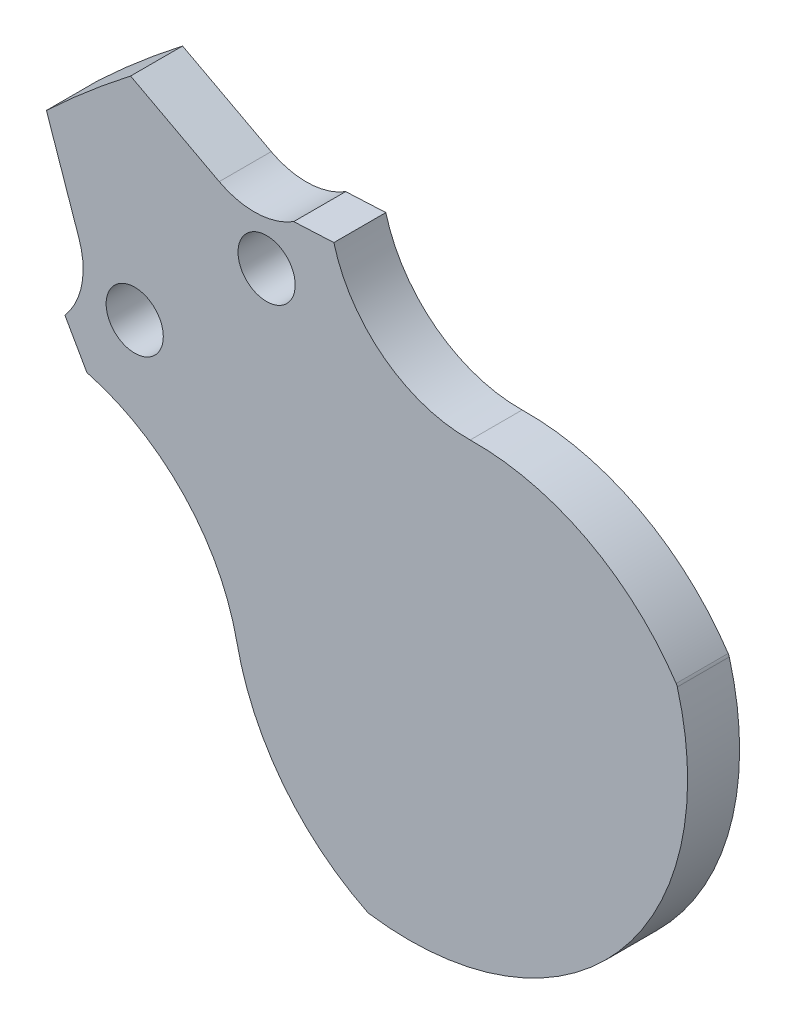
ISO-10303-21;
HEADER;
FILE_DESCRIPTION(('STEP AP214'),'2;1');
FILE_NAME('part.step','',(''),(''),'','','');
FILE_SCHEMA(('AUTOMOTIVE_DESIGN { 1 0 10303 214 1 1 1 1 }'));
ENDSEC;
DATA;
#1=APPLICATION_CONTEXT('core data for automotive mechanical design processes');
#2=APPLICATION_PROTOCOL_DEFINITION('international standard','automotive_design',2000,#1);
#3=PRODUCT_CONTEXT('',#1,'mechanical');
#4=PRODUCT('Part','Part','',(#3));
#5=PRODUCT_RELATED_PRODUCT_CATEGORY('part','',(#4));
#6=PRODUCT_DEFINITION_FORMATION('','',#4);
#7=PRODUCT_DEFINITION_CONTEXT('part definition',#1,'design');
#8=PRODUCT_DEFINITION('design','',#6,#7);
#9=PRODUCT_DEFINITION_SHAPE('','',#8);
#10=(LENGTH_UNIT() NAMED_UNIT(*) SI_UNIT(.MILLI.,.METRE.));
#11=(NAMED_UNIT(*) PLANE_ANGLE_UNIT() SI_UNIT($,.RADIAN.));
#12=(NAMED_UNIT(*) SI_UNIT($,.STERADIAN.) SOLID_ANGLE_UNIT());
#13=UNCERTAINTY_MEASURE_WITH_UNIT(LENGTH_MEASURE(1.E-05),#10,'distance_accuracy_value','');
#14=(GEOMETRIC_REPRESENTATION_CONTEXT(3) GLOBAL_UNCERTAINTY_ASSIGNED_CONTEXT((#13)) GLOBAL_UNIT_ASSIGNED_CONTEXT((#10,
#11,#12)) REPRESENTATION_CONTEXT('',''));
#15=CARTESIAN_POINT('',(0.,0.,0.));
#16=DIRECTION('',(0.,0.,1.));
#17=DIRECTION('',(1.,0.,0.));
#18=AXIS2_PLACEMENT_3D('',#15,#16,#17);
#19=CARTESIAN_POINT('',(0.,0.,0.));
#20=DIRECTION('',(0.,0.,-1.));
#21=DIRECTION('',(-1.,0.,0.));
#22=AXIS2_PLACEMENT_3D('',#19,#20,#21);
#23=PLANE('',#22);
#24=CARTESIAN_POINT('',(-40.305086527633,40.3050865276334,0.));
#25=DIRECTION('',(0.,0.,1.));
#26=DIRECTION('',(1.,0.,0.));
#27=AXIS2_PLACEMENT_3D('',#24,#25,#26);
#28=CIRCLE('',#27,1.65);
#29=CARTESIAN_POINT('',(-38.655086527633,40.3050865276334,0.));
#30=VERTEX_POINT('',#29);
#31=EDGE_CURVE('E213',#30,#30,#28,.T.);
#32=ORIENTED_EDGE('',*,*,#31,.T.);
#33=EDGE_LOOP('',(#32));
#34=FACE_BOUND('',#33,.T.);
#35=CARTESIAN_POINT('',(-32.6938568720097,46.6916665244725,0.));
#36=DIRECTION('',(0.,0.,1.));
#37=DIRECTION('',(1.,0.,0.));
#38=AXIS2_PLACEMENT_3D('',#35,#36,#37);
#39=CIRCLE('',#38,1.65);
#40=CARTESIAN_POINT('',(-31.0438568720097,46.6916665244725,0.));
#41=VERTEX_POINT('',#40);
#42=EDGE_CURVE('E217',#41,#41,#39,.T.);
#43=ORIENTED_EDGE('',*,*,#42,.T.);
#44=EDGE_LOOP('',(#43));
#45=FACE_BOUND('',#44,.T.);
#46=DIRECTION('',(-0.325568154457158,0.945518575599316,0.));
#47=VECTOR('',#46,1.);
#48=CARTESIAN_POINT('',(-25.7393794242524,-8.86277908471,0.));
#49=LINE('',#48,#47);
#50=CARTESIAN_POINT('',(-43.5149356100677,42.7611845468722,0.));
#51=VERTEX_POINT('',#50);
#52=CARTESIAN_POINT('',(-45.4014737679797,48.2400891862308,0.));
#53=VERTEX_POINT('',#52);
#54=EDGE_CURVE('E200',#51,#53,#49,.T.);
#55=ORIENTED_EDGE('',*,*,#54,.T.);
#56=CARTESIAN_POINT('',(0.,0.,0.));
#57=DIRECTION('',(0.,0.,-1.));
#58=DIRECTION('',(-1.,0.,0.));
#59=AXIS2_PLACEMENT_3D('',#56,#57,#58);
#60=CIRCLE('',#59,66.245);
#61=CARTESIAN_POINT('',(-40.5438183775776,52.3889188318103,0.));
#62=VERTEX_POINT('',#61);
#63=EDGE_CURVE('E108',#53,#62,#60,.T.);
#64=ORIENTED_EDGE('',*,*,#63,.T.);
#65=DIRECTION('',(-0.882947592858929,0.469471562785887,0.));
#66=VECTOR('',#65,1.);
#67=CARTESIAN_POINT('',(12.7801896179389,24.0360408466023,0.));
#68=LINE('',#67,#66);
#69=CARTESIAN_POINT('',(-35.4274877335618,49.6685175728884,0.));
#70=VERTEX_POINT('',#69);
#71=EDGE_CURVE('E198',#70,#62,#68,.T.);
#72=ORIENTED_EDGE('',*,*,#71,.F.);
#73=CARTESIAN_POINT('',(-33.4087600135825,53.4651922221818,0.));
#74=DIRECTION('',(0.,0.,1.));
#75=DIRECTION('',(0.,1.,0.));
#76=AXIS2_PLACEMENT_3D('',#73,#74,#75);
#77=CIRCLE('',#76,4.3);
#78=CARTESIAN_POINT('',(-31.1301071773797,49.8185854087092,0.));
#79=VERTEX_POINT('',#78);
#80=EDGE_CURVE('E206',#70,#79,#77,.T.);
#81=ORIENTED_EDGE('',*,*,#80,.T.);
#82=DIRECTION('',(0.998841807465223,0.0481149005985286,0.));
#83=VECTOR('',#82,1.);
#84=CARTESIAN_POINT('',(-28.8119682022395,49.9302517662133,0.));
#85=LINE('',#84,#83);
#86=CARTESIAN_POINT('',(-28.8119682022395,49.9302517662133,0.));
#87=VERTEX_POINT('',#86);
#88=EDGE_CURVE('E101',#79,#87,#85,.T.);
#89=ORIENTED_EDGE('',*,*,#88,.T.);
#90=CARTESIAN_POINT('',(-21.0834518417378,51.9966580344622,0.));
#91=DIRECTION('',(0.,0.,-1.));
#92=DIRECTION('',(1.,0.,0.));
#93=AXIS2_PLACEMENT_3D('',#90,#91,#92);
#94=CIRCLE('',#93,8.);
#95=CARTESIAN_POINT('',(-20.9440148083786,43.9978732946577,0.));
#96=VERTEX_POINT('',#95);
#97=EDGE_CURVE('E249',#96,#87,#94,.T.);
#98=ORIENTED_EDGE('',*,*,#97,.F.);
#99=CARTESIAN_POINT('',(-20.7,30.,0.));
#100=DIRECTION('',(0.,0.,1.));
#101=DIRECTION('',(1.,0.,0.));
#102=AXIS2_PLACEMENT_3D('',#99,#100,#101);
#103=CIRCLE('',#102,14.);
#104=CARTESIAN_POINT('',(-9.05558126311799,37.7722269833138,0.));
#105=VERTEX_POINT('',#104);
#106=EDGE_CURVE('E247',#105,#96,#103,.T.);
#107=ORIENTED_EDGE('',*,*,#106,.F.);
#108=CARTESIAN_POINT('',(-9.47145336086377,37.4946474481955,0.));
#109=DIRECTION('',(0.,0.,1.));
#110=DIRECTION('',(-1.,0.,0.));
#111=AXIS2_PLACEMENT_3D('',#108,#109,#110);
#112=CIRCLE('',#111,0.499999999999996);
#113=CARTESIAN_POINT('',(-8.9899709162586,37.6294608582741,0.));
#114=VERTEX_POINT('',#113);
#115=EDGE_CURVE('E245',#114,#105,#112,.T.);
#116=ORIENTED_EDGE('',*,*,#115,.F.);
#117=CARTESIAN_POINT('',(-24.4575686104347,33.2985872942633,0.));
#118=DIRECTION('',(0.,0.,1.));
#119=DIRECTION('',(1.,0.,0.));
#120=AXIS2_PLACEMENT_3D('',#117,#118,#119);
#121=CIRCLE('',#120,16.0624731674898);
#122=CARTESIAN_POINT('',(-26.7481863066767,17.4002818868939,0.));
#123=VERTEX_POINT('',#122);
#124=EDGE_CURVE('E242',#123,#114,#121,.T.);
#125=ORIENTED_EDGE('',*,*,#124,.F.);
#126=CARTESIAN_POINT('',(-26.6768829129727,17.8951715978864,0.));
#127=DIRECTION('',(0.,0.,1.));
#128=DIRECTION('',(1.,0.,0.));
#129=AXIS2_PLACEMENT_3D('',#126,#127,#128);
#130=CIRCLE('',#129,0.499999999999999);
#131=CARTESIAN_POINT('',(-26.8982489467865,17.4468446200304,0.));
#132=VERTEX_POINT('',#131);
#133=EDGE_CURVE('E239',#132,#123,#130,.T.);
#134=ORIENTED_EDGE('',*,*,#133,.F.);
#135=CARTESIAN_POINT('',(-20.7,30.,0.));
#136=DIRECTION('',(0.,0.,1.));
#137=DIRECTION('',(1.,0.,0.));
#138=AXIS2_PLACEMENT_3D('',#135,#136,#137);
#139=CIRCLE('',#138,14.);
#140=CARTESIAN_POINT('',(-34.4073900533592,27.1526401834206,0.));
#141=VERTEX_POINT('',#140);
#142=EDGE_CURVE('E225',#141,#132,#139,.T.);
#143=ORIENTED_EDGE('',*,*,#142,.F.);
#144=CARTESIAN_POINT('',(-46.156581527667,24.7120460549241,0.));
#145=DIRECTION('',(0.,0.,-1.));
#146=DIRECTION('',(-1.,0.,0.));
#147=AXIS2_PLACEMENT_3D('',#144,#145,#146);
#148=CIRCLE('',#147,12.);
#149=CARTESIAN_POINT('',(-43.0662239815876,36.3072903489176,0.));
#150=VERTEX_POINT('',#149);
#151=EDGE_CURVE('E252',#150,#141,#148,.T.);
#152=ORIENTED_EDGE('',*,*,#151,.F.);
#153=DIRECTION('',(-0.494156169465709,0.869373153587674,0.));
#154=VECTOR('',#153,1.);
#155=CARTESIAN_POINT('',(-44.3354142901868,38.5401876580473,0.));
#156=LINE('',#155,#154);
#157=CARTESIAN_POINT('',(-44.3354142901868,38.5401876580473,0.));
#158=VERTEX_POINT('',#157);
#159=EDGE_CURVE('E315',#150,#158,#156,.T.);
#160=ORIENTED_EDGE('',*,*,#159,.T.);
#161=CARTESIAN_POINT('',(-47.5806654851447,41.3612414827064,0.));
#162=DIRECTION('',(0.,0.,1.));
#163=DIRECTION('',(0.,1.,0.));
#164=AXIS2_PLACEMENT_3D('',#161,#162,#163);
#165=CIRCLE('',#164,4.3);
#166=EDGE_CURVE('E291',#158,#51,#165,.T.);
#167=ORIENTED_EDGE('',*,*,#166,.T.);
#168=EDGE_LOOP('',(#55,#64,#72,#81,#89,#98,#107,#116,#125,#134,#143,#152,#160,#167));
#169=FACE_BOUND('',#168,.T.);
#170=ADVANCED_FACE('F87',(#34,#45,#169),#23,.T.);
#171=CARTESIAN_POINT('',(-21.0834518417378,51.9966580344622,3.));
#172=DIRECTION('',(0.,0.,-1.));
#173=DIRECTION('',(-1.,0.,0.));
#174=AXIS2_PLACEMENT_3D('',#171,#172,#173);
#175=CYLINDRICAL_SURFACE('',#174,8.);
#176=DIRECTION('',(0.,0.,-1.));
#177=VECTOR('',#176,1.);
#178=CARTESIAN_POINT('',(-28.8119682022395,49.9302517662133,115.));
#179=LINE('',#178,#177);
#180=CARTESIAN_POINT('',(-28.8119682022395,49.9302517662133,3.));
#181=VERTEX_POINT('',#180);
#182=EDGE_CURVE('E192',#181,#87,#179,.T.);
#183=ORIENTED_EDGE('',*,*,#182,.F.);
#184=CARTESIAN_POINT('',(-21.0834518417378,51.9966580344622,3.));
#185=DIRECTION('',(0.,0.,-1.));
#186=DIRECTION('',(1.,0.,0.));
#187=AXIS2_PLACEMENT_3D('',#184,#185,#186);
#188=CIRCLE('',#187,8.);
#189=CARTESIAN_POINT('',(-20.9440148083786,43.9978732946577,3.));
#190=VERTEX_POINT('',#189);
#191=EDGE_CURVE('E231',#190,#181,#188,.T.);
#192=ORIENTED_EDGE('',*,*,#191,.F.);
#193=DIRECTION('',(0.,0.,-1.));
#194=VECTOR('',#193,1.);
#195=CARTESIAN_POINT('',(-20.9440148083786,43.9978732946577,3.));
#196=LINE('',#195,#194);
#197=EDGE_CURVE('E260',#190,#96,#196,.T.);
#198=ORIENTED_EDGE('',*,*,#197,.T.);
#199=ORIENTED_EDGE('',*,*,#97,.T.);
#200=EDGE_LOOP('',(#183,#192,#198,#199));
#201=FACE_BOUND('',#200,.T.);
#202=ADVANCED_FACE('F321',(#201),#175,.F.);
#203=CARTESIAN_POINT('',(-46.156581527667,24.7120460549241,3.));
#204=DIRECTION('',(0.,0.,-1.));
#205=DIRECTION('',(-1.,0.,0.));
#206=AXIS2_PLACEMENT_3D('',#203,#204,#205);
#207=CYLINDRICAL_SURFACE('',#206,12.);
#208=DIRECTION('',(0.,0.,-1.));
#209=VECTOR('',#208,1.);
#210=CARTESIAN_POINT('',(-43.0662239815876,36.3072903489176,115.));
#211=LINE('',#210,#209);
#212=CARTESIAN_POINT('',(-43.0662239815876,36.3072903489176,3.));
#213=VERTEX_POINT('',#212);
#214=EDGE_CURVE('E310',#213,#150,#211,.T.);
#215=ORIENTED_EDGE('',*,*,#214,.T.);
#216=ORIENTED_EDGE('',*,*,#151,.T.);
#217=DIRECTION('',(0.,0.,-1.));
#218=VECTOR('',#217,1.);
#219=CARTESIAN_POINT('',(-34.4073900533592,27.1526401834206,3.));
#220=LINE('',#219,#218);
#221=CARTESIAN_POINT('',(-34.4073900533592,27.1526401834206,3.));
#222=VERTEX_POINT('',#221);
#223=EDGE_CURVE('E257',#222,#141,#220,.T.);
#224=ORIENTED_EDGE('',*,*,#223,.F.);
#225=CARTESIAN_POINT('',(-46.156581527667,24.7120460549241,3.));
#226=DIRECTION('',(0.,0.,-1.));
#227=DIRECTION('',(-1.,0.,0.));
#228=AXIS2_PLACEMENT_3D('',#225,#226,#227);
#229=CIRCLE('',#228,12.);
#230=EDGE_CURVE('E234',#213,#222,#229,.T.);
#231=ORIENTED_EDGE('',*,*,#230,.F.);
#232=EDGE_LOOP('',(#215,#216,#224,#231));
#233=FACE_BOUND('',#232,.T.);
#234=ADVANCED_FACE('F348',(#233),#207,.F.);
#235=CARTESIAN_POINT('',(-25.5672257617037,25.5968794460749,3.));
#236=DIRECTION('',(0.,0.,1.));
#237=DIRECTION('',(1.,0.,0.));
#238=AXIS2_PLACEMENT_3D('',#235,#236,#237);
#239=PLANE('',#238);
#240=CARTESIAN_POINT('',(-40.305086527633,40.3050865276334,3.));
#241=DIRECTION('',(0.,0.,1.));
#242=DIRECTION('',(1.,0.,0.));
#243=AXIS2_PLACEMENT_3D('',#240,#241,#242);
#244=CIRCLE('',#243,1.65);
#245=CARTESIAN_POINT('',(-38.655086527633,40.3050865276334,3.));
#246=VERTEX_POINT('',#245);
#247=EDGE_CURVE('E243',#246,#246,#244,.F.);
#248=ORIENTED_EDGE('',*,*,#247,.T.);
#249=EDGE_LOOP('',(#248));
#250=FACE_BOUND('',#249,.T.);
#251=CARTESIAN_POINT('',(-32.6938568720097,46.6916665244725,3.));
#252=DIRECTION('',(0.,0.,1.));
#253=DIRECTION('',(1.,0.,0.));
#254=AXIS2_PLACEMENT_3D('',#251,#252,#253);
#255=CIRCLE('',#254,1.65);
#256=CARTESIAN_POINT('',(-31.0438568720097,46.6916665244725,3.));
#257=VERTEX_POINT('',#256);
#258=EDGE_CURVE('E216',#257,#257,#255,.F.);
#259=ORIENTED_EDGE('',*,*,#258,.T.);
#260=EDGE_LOOP('',(#259));
#261=FACE_BOUND('',#260,.T.);
#262=DIRECTION('',(0.882947592858929,-0.469471562785887,0.));
#263=VECTOR('',#262,1.);
#264=CARTESIAN_POINT('',(-17.7623162670816,40.2757792922438,3.));
#265=LINE('',#264,#263);
#266=CARTESIAN_POINT('',(-40.5438183775776,52.3889188318103,3.));
#267=VERTEX_POINT('',#266);
#268=CARTESIAN_POINT('',(-35.4274877335618,49.6685175728884,3.));
#269=VERTEX_POINT('',#268);
#270=EDGE_CURVE('E279',#267,#269,#265,.T.);
#271=ORIENTED_EDGE('',*,*,#270,.F.);
#272=CARTESIAN_POINT('',(0.,0.,3.));
#273=DIRECTION('',(0.,0.,1.));
#274=DIRECTION('',(1.,0.,0.));
#275=AXIS2_PLACEMENT_3D('',#272,#273,#274);
#276=CIRCLE('',#275,66.245);
#277=CARTESIAN_POINT('',(-45.4014737679796,48.2400891862304,3.));
#278=VERTEX_POINT('',#277);
#279=EDGE_CURVE('E187',#267,#278,#276,.T.);
#280=ORIENTED_EDGE('',*,*,#279,.T.);
#281=DIRECTION('',(0.325568154457158,-0.945518575599316,0.));
#282=VECTOR('',#281,1.);
#283=CARTESIAN_POINT('',(-36.3288741667994,21.8913467356857,3.));
#284=LINE('',#283,#282);
#285=CARTESIAN_POINT('',(-43.5149356100677,42.7611845468722,3.));
#286=VERTEX_POINT('',#285);
#287=EDGE_CURVE('E281',#278,#286,#284,.T.);
#288=ORIENTED_EDGE('',*,*,#287,.T.);
#289=CARTESIAN_POINT('',(-47.5806654851447,41.3612414827064,3.));
#290=DIRECTION('',(0.,0.,1.));
#291=DIRECTION('',(1.,0.,0.));
#292=AXIS2_PLACEMENT_3D('',#289,#290,#291);
#293=CIRCLE('',#292,4.3);
#294=CARTESIAN_POINT('',(-44.3354142901868,38.5401876580473,3.));
#295=VERTEX_POINT('',#294);
#296=EDGE_CURVE('E283',#286,#295,#293,.F.);
#297=ORIENTED_EDGE('',*,*,#296,.T.);
#298=DIRECTION('',(0.494156169465709,-0.869373153587674,0.));
#299=VECTOR('',#298,1.);
#300=CARTESIAN_POINT('',(-34.1918800729604,20.6945816009796,3.));
#301=LINE('',#300,#299);
#302=EDGE_CURVE('E191',#295,#213,#301,.T.);
#303=ORIENTED_EDGE('',*,*,#302,.T.);
#304=ORIENTED_EDGE('',*,*,#230,.T.);
#305=CARTESIAN_POINT('',(-20.7,30.,3.));
#306=DIRECTION('',(0.,0.,1.));
#307=DIRECTION('',(1.,0.,0.));
#308=AXIS2_PLACEMENT_3D('',#305,#306,#307);
#309=CIRCLE('',#308,14.);
#310=CARTESIAN_POINT('',(-26.8982489467865,17.4468446200304,3.));
#311=VERTEX_POINT('',#310);
#312=EDGE_CURVE('E236',#222,#311,#309,.T.);
#313=ORIENTED_EDGE('',*,*,#312,.T.);
#314=CARTESIAN_POINT('',(-26.6768829129727,17.8951715978864,3.));
#315=DIRECTION('',(0.,0.,1.));
#316=DIRECTION('',(1.,0.,0.));
#317=AXIS2_PLACEMENT_3D('',#314,#315,#316);
#318=CIRCLE('',#317,0.499999999999999);
#319=CARTESIAN_POINT('',(-26.7481863066767,17.4002818868939,3.));
#320=VERTEX_POINT('',#319);
#321=EDGE_CURVE('E221',#311,#320,#318,.T.);
#322=ORIENTED_EDGE('',*,*,#321,.T.);
#323=CARTESIAN_POINT('',(-24.4575686104347,33.2985872942633,3.));
#324=DIRECTION('',(0.,0.,1.));
#325=DIRECTION('',(1.,0.,0.));
#326=AXIS2_PLACEMENT_3D('',#323,#324,#325);
#327=CIRCLE('',#326,16.0624731674898);
#328=CARTESIAN_POINT('',(-8.9899709162586,37.6294608582741,3.));
#329=VERTEX_POINT('',#328);
#330=EDGE_CURVE('E224',#320,#329,#327,.T.);
#331=ORIENTED_EDGE('',*,*,#330,.T.);
#332=CARTESIAN_POINT('',(-9.47145336086377,37.4946474481955,3.));
#333=DIRECTION('',(0.,0.,1.));
#334=DIRECTION('',(-1.,0.,0.));
#335=AXIS2_PLACEMENT_3D('',#332,#333,#334);
#336=CIRCLE('',#335,0.499999999999996);
#337=CARTESIAN_POINT('',(-9.05558126311799,37.7722269833138,3.));
#338=VERTEX_POINT('',#337);
#339=EDGE_CURVE('E227',#329,#338,#336,.T.);
#340=ORIENTED_EDGE('',*,*,#339,.T.);
#341=CARTESIAN_POINT('',(-20.7,30.,3.));
#342=DIRECTION('',(0.,0.,1.));
#343=DIRECTION('',(1.,0.,0.));
#344=AXIS2_PLACEMENT_3D('',#341,#342,#343);
#345=CIRCLE('',#344,14.);
#346=EDGE_CURVE('E229',#338,#190,#345,.T.);
#347=ORIENTED_EDGE('',*,*,#346,.T.);
#348=ORIENTED_EDGE('',*,*,#191,.T.);
#349=DIRECTION('',(-0.998841807465223,-0.0481149005985286,0.));
#350=VECTOR('',#349,1.);
#351=CARTESIAN_POINT('',(-26.7441792632676,50.0298585893496,3.));
#352=LINE('',#351,#350);
#353=CARTESIAN_POINT('',(-31.1301071773797,49.8185854087092,3.));
#354=VERTEX_POINT('',#353);
#355=EDGE_CURVE('E209',#181,#354,#352,.T.);
#356=ORIENTED_EDGE('',*,*,#355,.T.);
#357=CARTESIAN_POINT('',(-33.4087600135825,53.4651922221818,3.));
#358=DIRECTION('',(0.,0.,1.));
#359=DIRECTION('',(1.,0.,0.));
#360=AXIS2_PLACEMENT_3D('',#357,#358,#359);
#361=CIRCLE('',#360,4.3);
#362=EDGE_CURVE('E272',#354,#269,#361,.F.);
#363=ORIENTED_EDGE('',*,*,#362,.T.);
#364=EDGE_LOOP('',(#271,#280,#288,#297,#303,#304,#313,#322,#331,#340,#347,#348,#356,#363));
#365=FACE_BOUND('',#364,.T.);
#366=ADVANCED_FACE('F296',(#250,#261,#365),#239,.T.);
#367=CARTESIAN_POINT('',(12.7801896179389,24.0360408466023,115.));
#368=DIRECTION('',(-0.469471562785887,-0.882947592858929,0.));
#369=DIRECTION('',(0.882947592858929,-0.469471562785887,0.));
#370=AXIS2_PLACEMENT_3D('',#367,#368,#369);
#371=PLANE('',#370);
#372=DIRECTION('',(0.,0.,-1.));
#373=VECTOR('',#372,1.);
#374=CARTESIAN_POINT('',(-40.5438183775776,52.3889188318103,115.));
#375=LINE('',#374,#373);
#376=EDGE_CURVE('E184',#267,#62,#375,.T.);
#377=ORIENTED_EDGE('',*,*,#376,.F.);
#378=ORIENTED_EDGE('',*,*,#270,.T.);
#379=DIRECTION('',(0.,0.,-1.));
#380=VECTOR('',#379,1.);
#381=CARTESIAN_POINT('',(-35.4274877335618,49.6685175728884,115.));
#382=LINE('',#381,#380);
#383=EDGE_CURVE('E204',#269,#70,#382,.T.);
#384=ORIENTED_EDGE('',*,*,#383,.T.);
#385=ORIENTED_EDGE('',*,*,#71,.T.);
#386=EDGE_LOOP('',(#377,#378,#384,#385));
#387=FACE_BOUND('',#386,.T.);
#388=ADVANCED_FACE('F202',(#387),#371,.F.);
#389=CARTESIAN_POINT('',(-33.4087600135825,53.4651922221818,115.));
#390=DIRECTION('',(0.,0.,-1.));
#391=DIRECTION('',(-1.,0.,0.));
#392=AXIS2_PLACEMENT_3D('',#389,#390,#391);
#393=CYLINDRICAL_SURFACE('',#392,4.3);
#394=ORIENTED_EDGE('',*,*,#362,.F.);
#395=DIRECTION('',(0.,0.,-1.));
#396=VECTOR('',#395,1.);
#397=CARTESIAN_POINT('',(-31.1301071773797,49.8185854087092,115.));
#398=LINE('',#397,#396);
#399=EDGE_CURVE('E12',#354,#79,#398,.T.);
#400=ORIENTED_EDGE('',*,*,#399,.T.);
#401=ORIENTED_EDGE('',*,*,#80,.F.);
#402=ORIENTED_EDGE('',*,*,#383,.F.);
#403=EDGE_LOOP('',(#394,#400,#401,#402));
#404=FACE_BOUND('',#403,.T.);
#405=ADVANCED_FACE('F401',(#404),#393,.F.);
#406=CARTESIAN_POINT('',(-25.7393794242524,-8.86277908471,115.));
#407=DIRECTION('',(-0.945518575599316,-0.325568154457158,0.));
#408=DIRECTION('',(0.325568154457158,-0.945518575599316,0.));
#409=AXIS2_PLACEMENT_3D('',#406,#407,#408);
#410=PLANE('',#409);
#411=ORIENTED_EDGE('',*,*,#287,.F.);
#412=DIRECTION('',(0.,0.,-1.));
#413=VECTOR('',#412,1.);
#414=CARTESIAN_POINT('',(-45.4014737679796,48.2400891862304,115.));
#415=LINE('',#414,#413);
#416=EDGE_CURVE('E313',#278,#53,#415,.T.);
#417=ORIENTED_EDGE('',*,*,#416,.T.);
#418=ORIENTED_EDGE('',*,*,#54,.F.);
#419=DIRECTION('',(0.,0.,-1.));
#420=VECTOR('',#419,1.);
#421=CARTESIAN_POINT('',(-43.5149356100677,42.7611845468722,115.));
#422=LINE('',#421,#420);
#423=EDGE_CURVE('E220',#286,#51,#422,.T.);
#424=ORIENTED_EDGE('',*,*,#423,.F.);
#425=EDGE_LOOP('',(#411,#417,#418,#424));
#426=FACE_BOUND('',#425,.T.);
#427=ADVANCED_FACE('F301',(#426),#410,.T.);
#428=CARTESIAN_POINT('',(-47.5806654851447,41.3612414827064,115.));
#429=DIRECTION('',(0.,0.,-1.));
#430=DIRECTION('',(-1.,0.,0.));
#431=AXIS2_PLACEMENT_3D('',#428,#429,#430);
#432=CYLINDRICAL_SURFACE('',#431,4.3);
#433=ORIENTED_EDGE('',*,*,#166,.F.);
#434=DIRECTION('',(0.,0.,-1.));
#435=VECTOR('',#434,1.);
#436=CARTESIAN_POINT('',(-44.3354142901868,38.5401876580473,115.));
#437=LINE('',#436,#435);
#438=EDGE_CURVE('E94',#158,#295,#437,.F.);
#439=ORIENTED_EDGE('',*,*,#438,.T.);
#440=ORIENTED_EDGE('',*,*,#296,.F.);
#441=ORIENTED_EDGE('',*,*,#423,.T.);
#442=EDGE_LOOP('',(#433,#439,#440,#441));
#443=FACE_BOUND('',#442,.T.);
#444=ADVANCED_FACE('F289',(#443),#432,.F.);
#445=CARTESIAN_POINT('',(-26.6768829129727,17.8951715978864,3.));
#446=DIRECTION('',(0.,0.,-1.));
#447=DIRECTION('',(-1.,0.,0.));
#448=AXIS2_PLACEMENT_3D('',#445,#446,#447);
#449=CYLINDRICAL_SURFACE('',#448,0.499999999999999);
#450=ORIENTED_EDGE('',*,*,#133,.T.);
#451=DIRECTION('',(0.,0.,-1.));
#452=VECTOR('',#451,1.);
#453=CARTESIAN_POINT('',(-26.7481863066767,17.4002818868939,3.));
#454=LINE('',#453,#452);
#455=EDGE_CURVE('E269',#320,#123,#454,.T.);
#456=ORIENTED_EDGE('',*,*,#455,.F.);
#457=ORIENTED_EDGE('',*,*,#321,.F.);
#458=DIRECTION('',(0.,0.,-1.));
#459=VECTOR('',#458,1.);
#460=CARTESIAN_POINT('',(-26.8982489467865,17.4468446200304,3.));
#461=LINE('',#460,#459);
#462=EDGE_CURVE('E238',#311,#132,#461,.T.);
#463=ORIENTED_EDGE('',*,*,#462,.T.);
#464=EDGE_LOOP('',(#450,#456,#457,#463));
#465=FACE_BOUND('',#464,.T.);
#466=ADVANCED_FACE('F339',(#465),#449,.T.);
#467=CARTESIAN_POINT('',(-24.4575686104347,33.2985872942633,3.));
#468=DIRECTION('',(0.,0.,-1.));
#469=DIRECTION('',(-1.,0.,0.));
#470=AXIS2_PLACEMENT_3D('',#467,#468,#469);
#471=CYLINDRICAL_SURFACE('',#470,16.0624731674898);
#472=ORIENTED_EDGE('',*,*,#124,.T.);
#473=DIRECTION('',(0.,0.,-1.));
#474=VECTOR('',#473,1.);
#475=CARTESIAN_POINT('',(-8.9899709162586,37.6294608582741,3.));
#476=LINE('',#475,#474);
#477=EDGE_CURVE('E266',#329,#114,#476,.T.);
#478=ORIENTED_EDGE('',*,*,#477,.F.);
#479=ORIENTED_EDGE('',*,*,#330,.F.);
#480=ORIENTED_EDGE('',*,*,#455,.T.);
#481=EDGE_LOOP('',(#472,#478,#479,#480));
#482=FACE_BOUND('',#481,.T.);
#483=ADVANCED_FACE('F335',(#482),#471,.T.);
#484=CARTESIAN_POINT('',(-9.47145336086377,37.4946474481955,3.));
#485=DIRECTION('',(0.,0.,-1.));
#486=DIRECTION('',(-1.,0.,0.));
#487=AXIS2_PLACEMENT_3D('',#484,#485,#486);
#488=CYLINDRICAL_SURFACE('',#487,0.499999999999996);
#489=ORIENTED_EDGE('',*,*,#115,.T.);
#490=DIRECTION('',(0.,0.,-1.));
#491=VECTOR('',#490,1.);
#492=CARTESIAN_POINT('',(-9.05558126311799,37.7722269833138,3.));
#493=LINE('',#492,#491);
#494=EDGE_CURVE('E263',#338,#105,#493,.T.);
#495=ORIENTED_EDGE('',*,*,#494,.F.);
#496=ORIENTED_EDGE('',*,*,#339,.F.);
#497=ORIENTED_EDGE('',*,*,#477,.T.);
#498=EDGE_LOOP('',(#489,#495,#496,#497));
#499=FACE_BOUND('',#498,.T.);
#500=ADVANCED_FACE('F331',(#499),#488,.T.);
#501=CARTESIAN_POINT('',(-20.7,30.,3.));
#502=DIRECTION('',(0.,0.,-1.));
#503=DIRECTION('',(-1.,0.,0.));
#504=AXIS2_PLACEMENT_3D('',#501,#502,#503);
#505=CYLINDRICAL_SURFACE('',#504,14.);
#506=ORIENTED_EDGE('',*,*,#106,.T.);
#507=ORIENTED_EDGE('',*,*,#197,.F.);
#508=ORIENTED_EDGE('',*,*,#346,.F.);
#509=ORIENTED_EDGE('',*,*,#494,.T.);
#510=EDGE_LOOP('',(#506,#507,#508,#509));
#511=FACE_BOUND('',#510,.T.);
#512=ADVANCED_FACE('F326',(#511),#505,.T.);
#513=CARTESIAN_POINT('',(-20.7,30.,3.));
#514=DIRECTION('',(0.,0.,-1.));
#515=DIRECTION('',(-1.,0.,0.));
#516=AXIS2_PLACEMENT_3D('',#513,#514,#515);
#517=CYLINDRICAL_SURFACE('',#516,14.);
#518=ORIENTED_EDGE('',*,*,#142,.T.);
#519=ORIENTED_EDGE('',*,*,#462,.F.);
#520=ORIENTED_EDGE('',*,*,#312,.F.);
#521=ORIENTED_EDGE('',*,*,#223,.T.);
#522=EDGE_LOOP('',(#518,#519,#520,#521));
#523=FACE_BOUND('',#522,.T.);
#524=ADVANCED_FACE('F344',(#523),#517,.T.);
#525=CARTESIAN_POINT('',(-32.6938568720097,46.6916665244725,115.));
#526=DIRECTION('',(0.,0.,-1.));
#527=DIRECTION('',(-1.,0.,0.));
#528=AXIS2_PLACEMENT_3D('',#525,#526,#527);
#529=CYLINDRICAL_SURFACE('',#528,1.65);
#530=ORIENTED_EDGE('',*,*,#258,.F.);
#531=EDGE_LOOP('',(#530));
#532=FACE_BOUND('',#531,.T.);
#533=ORIENTED_EDGE('',*,*,#42,.F.);
#534=EDGE_LOOP('',(#533));
#535=FACE_BOUND('',#534,.T.);
#536=ADVANCED_FACE('F360',(#532,#535),#529,.F.);
#537=CARTESIAN_POINT('',(-40.305086527633,40.3050865276334,115.));
#538=DIRECTION('',(0.,0.,-1.));
#539=DIRECTION('',(-1.,0.,0.));
#540=AXIS2_PLACEMENT_3D('',#537,#538,#539);
#541=CYLINDRICAL_SURFACE('',#540,1.65);
#542=ORIENTED_EDGE('',*,*,#247,.F.);
#543=EDGE_LOOP('',(#542));
#544=FACE_BOUND('',#543,.T.);
#545=ORIENTED_EDGE('',*,*,#31,.F.);
#546=EDGE_LOOP('',(#545));
#547=FACE_BOUND('',#546,.T.);
#548=ADVANCED_FACE('F351',(#544,#547),#541,.F.);
#549=CARTESIAN_POINT('',(-44.3354142901868,38.5401876580473,115.));
#550=DIRECTION('',(-0.869373153587674,-0.494156169465709,0.));
#551=DIRECTION('',(0.494156169465709,-0.869373153587674,0.));
#552=AXIS2_PLACEMENT_3D('',#549,#550,#551);
#553=PLANE('',#552);
#554=ORIENTED_EDGE('',*,*,#438,.F.);
#555=ORIENTED_EDGE('',*,*,#159,.F.);
#556=ORIENTED_EDGE('',*,*,#214,.F.);
#557=ORIENTED_EDGE('',*,*,#302,.F.);
#558=EDGE_LOOP('',(#554,#555,#556,#557));
#559=FACE_BOUND('',#558,.T.);
#560=ADVANCED_FACE('F349',(#559),#553,.T.);
#561=CARTESIAN_POINT('',(0.,0.,115.));
#562=DIRECTION('',(0.,0.,-1.));
#563=DIRECTION('',(-1.,0.,0.));
#564=AXIS2_PLACEMENT_3D('',#561,#562,#563);
#565=CYLINDRICAL_SURFACE('',#564,66.245);
#566=ORIENTED_EDGE('',*,*,#376,.T.);
#567=ORIENTED_EDGE('',*,*,#63,.F.);
#568=ORIENTED_EDGE('',*,*,#416,.F.);
#569=ORIENTED_EDGE('',*,*,#279,.F.);
#570=EDGE_LOOP('',(#566,#567,#568,#569));
#571=FACE_BOUND('',#570,.T.);
#572=ADVANCED_FACE('F185',(#571),#565,.T.);
#573=CARTESIAN_POINT('',(-28.8119682022395,49.9302517662133,115.));
#574=DIRECTION('',(-0.0481149005985286,0.998841807465223,0.));
#575=DIRECTION('',(-0.998841807465223,-0.0481149005985286,0.));
#576=AXIS2_PLACEMENT_3D('',#573,#574,#575);
#577=PLANE('',#576);
#578=ORIENTED_EDGE('',*,*,#182,.T.);
#579=ORIENTED_EDGE('',*,*,#88,.F.);
#580=ORIENTED_EDGE('',*,*,#399,.F.);
#581=ORIENTED_EDGE('',*,*,#355,.F.);
#582=EDGE_LOOP('',(#578,#579,#580,#581));
#583=FACE_BOUND('',#582,.T.);
#584=ADVANCED_FACE('F357',(#583),#577,.T.);
#585=CLOSED_SHELL('',(#170,#202,#234,#366,#388,#405,#427,#444,#466,#483,#500,#512,#524,#536,
#548,#560,#572,#584));
#586=MANIFOLD_SOLID_BREP('B2',#585);
#587=ADVANCED_BREP_SHAPE_REPRESENTATION('',(#18,#586),#14);
#588=SHAPE_DEFINITION_REPRESENTATION(#9,#587);
ENDSEC;
END-ISO-10303-21;
